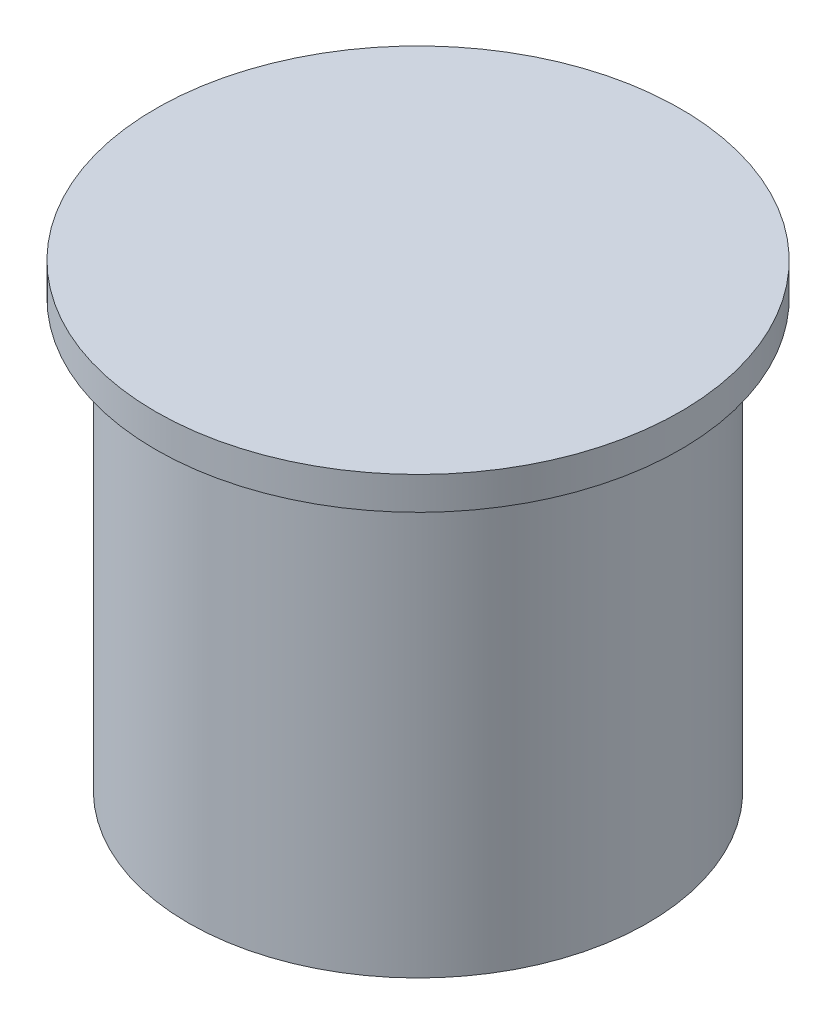
ISO-10303-21;
HEADER;
FILE_DESCRIPTION(('STEP AP214'),'2;1');
FILE_NAME('part.step','',(''),(''),'','','');
FILE_SCHEMA(('AUTOMOTIVE_DESIGN { 1 0 10303 214 1 1 1 1 }'));
ENDSEC;
DATA;
#1=APPLICATION_CONTEXT('core data for automotive mechanical design processes');
#2=APPLICATION_PROTOCOL_DEFINITION('international standard','automotive_design',2000,#1);
#3=PRODUCT_CONTEXT('',#1,'mechanical');
#4=PRODUCT('Part','Part','',(#3));
#5=PRODUCT_RELATED_PRODUCT_CATEGORY('part','',(#4));
#6=PRODUCT_DEFINITION_FORMATION('','',#4);
#7=PRODUCT_DEFINITION_CONTEXT('part definition',#1,'design');
#8=PRODUCT_DEFINITION('design','',#6,#7);
#9=PRODUCT_DEFINITION_SHAPE('','',#8);
#10=(LENGTH_UNIT() NAMED_UNIT(*) SI_UNIT(.MILLI.,.METRE.));
#11=(NAMED_UNIT(*) PLANE_ANGLE_UNIT() SI_UNIT($,.RADIAN.));
#12=(NAMED_UNIT(*) SI_UNIT($,.STERADIAN.) SOLID_ANGLE_UNIT());
#13=UNCERTAINTY_MEASURE_WITH_UNIT(LENGTH_MEASURE(1.E-05),#10,'distance_accuracy_value','');
#14=(GEOMETRIC_REPRESENTATION_CONTEXT(3) GLOBAL_UNCERTAINTY_ASSIGNED_CONTEXT((#13)) GLOBAL_UNIT_ASSIGNED_CONTEXT((#10,
#11,#12)) REPRESENTATION_CONTEXT('',''));
#15=CARTESIAN_POINT('',(0.,0.,0.));
#16=DIRECTION('',(0.,0.,1.));
#17=DIRECTION('',(1.,0.,0.));
#18=AXIS2_PLACEMENT_3D('',#15,#16,#17);
#19=CARTESIAN_POINT('',(0.,14.,0.));
#20=DIRECTION('',(0.,-1.,0.));
#21=DIRECTION('',(0.,0.,-1.));
#22=AXIS2_PLACEMENT_3D('',#19,#20,#21);
#23=PLANE('',#22);
#24=CARTESIAN_POINT('',(0.,14.,0.));
#25=DIRECTION('',(0.,1.,0.));
#26=DIRECTION('',(0.,0.,1.));
#27=AXIS2_PLACEMENT_3D('',#24,#25,#26);
#28=CIRCLE('',#27,8.);
#29=CARTESIAN_POINT('',(0.,14.,8.));
#30=VERTEX_POINT('',#29);
#31=EDGE_CURVE('E10',#30,#30,#28,.T.);
#32=ORIENTED_EDGE('',*,*,#31,.T.);
#33=EDGE_LOOP('',(#32));
#34=FACE_BOUND('',#33,.T.);
#35=ADVANCED_FACE('F31',(#34),#23,.F.);
#36=CARTESIAN_POINT('',(0.,18.0114497225876,0.));
#37=DIRECTION('',(0.,1.,0.));
#38=DIRECTION('',(0.,0.,1.));
#39=AXIS2_PLACEMENT_3D('',#36,#37,#38);
#40=CYLINDRICAL_SURFACE('',#39,8.);
#41=ORIENTED_EDGE('',*,*,#31,.F.);
#42=EDGE_LOOP('',(#41));
#43=FACE_BOUND('',#42,.T.);
#44=CARTESIAN_POINT('',(0.,13.,0.));
#45=DIRECTION('',(0.,1.,0.));
#46=DIRECTION('',(0.,0.,1.));
#47=AXIS2_PLACEMENT_3D('',#44,#45,#46);
#48=CIRCLE('',#47,8.);
#49=CARTESIAN_POINT('',(0.,13.,8.));
#50=VERTEX_POINT('',#49);
#51=EDGE_CURVE('E37',#50,#50,#48,.T.);
#52=ORIENTED_EDGE('',*,*,#51,.T.);
#53=EDGE_LOOP('',(#52));
#54=FACE_BOUND('',#53,.T.);
#55=ADVANCED_FACE('F63',(#43,#54),#40,.T.);
#56=CARTESIAN_POINT('',(8.,13.,0.));
#57=DIRECTION('',(0.,1.,0.));
#58=DIRECTION('',(0.,0.,1.));
#59=AXIS2_PLACEMENT_3D('',#56,#57,#58);
#60=PLANE('',#59);
#61=ORIENTED_EDGE('',*,*,#51,.F.);
#62=EDGE_LOOP('',(#61));
#63=FACE_BOUND('',#62,.T.);
#64=CARTESIAN_POINT('',(0.,13.,0.));
#65=DIRECTION('',(0.,1.,0.));
#66=DIRECTION('',(0.,0.,1.));
#67=AXIS2_PLACEMENT_3D('',#64,#65,#66);
#68=CIRCLE('',#67,7.);
#69=CARTESIAN_POINT('',(0.,13.,7.));
#70=VERTEX_POINT('',#69);
#71=EDGE_CURVE('E41',#70,#70,#68,.T.);
#72=ORIENTED_EDGE('',*,*,#71,.T.);
#73=EDGE_LOOP('',(#72));
#74=FACE_BOUND('',#73,.T.);
#75=ADVANCED_FACE('F59',(#63,#74),#60,.F.);
#76=CARTESIAN_POINT('',(0.,18.0114497225876,0.));
#77=DIRECTION('',(0.,1.,0.));
#78=DIRECTION('',(0.,0.,1.));
#79=AXIS2_PLACEMENT_3D('',#76,#77,#78);
#80=CYLINDRICAL_SURFACE('',#79,7.);
#81=ORIENTED_EDGE('',*,*,#71,.F.);
#82=EDGE_LOOP('',(#81));
#83=FACE_BOUND('',#82,.T.);
#84=CARTESIAN_POINT('',(0.,0.,0.));
#85=DIRECTION('',(0.,1.,0.));
#86=DIRECTION('',(0.,0.,1.));
#87=AXIS2_PLACEMENT_3D('',#84,#85,#86);
#88=CIRCLE('',#87,7.);
#89=CARTESIAN_POINT('',(0.,0.,7.));
#90=VERTEX_POINT('',#89);
#91=EDGE_CURVE('E45',#90,#90,#88,.T.);
#92=ORIENTED_EDGE('',*,*,#91,.T.);
#93=EDGE_LOOP('',(#92));
#94=FACE_BOUND('',#93,.T.);
#95=ADVANCED_FACE('F51',(#83,#94),#80,.T.);
#96=CARTESIAN_POINT('',(7.,0.,0.));
#97=DIRECTION('',(0.,1.,0.));
#98=DIRECTION('',(0.,0.,1.));
#99=AXIS2_PLACEMENT_3D('',#96,#97,#98);
#100=PLANE('',#99);
#101=ORIENTED_EDGE('',*,*,#91,.F.);
#102=EDGE_LOOP('',(#101));
#103=FACE_BOUND('',#102,.T.);
#104=ADVANCED_FACE('F53',(#103),#100,.F.);
#105=CLOSED_SHELL('',(#35,#55,#75,#95,#104));
#106=MANIFOLD_SOLID_BREP('B2',#105);
#107=ADVANCED_BREP_SHAPE_REPRESENTATION('',(#18,#106),#14);
#108=SHAPE_DEFINITION_REPRESENTATION(#9,#107);
ENDSEC;
END-ISO-10303-21;
